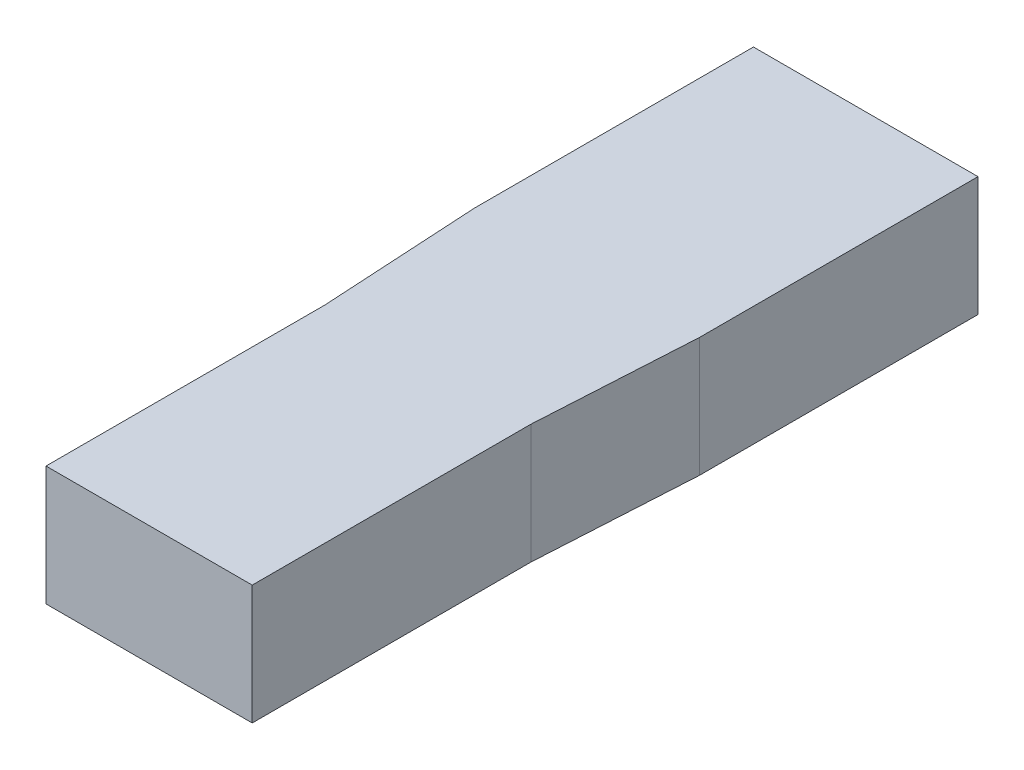
ISO-10303-21;
HEADER;
FILE_DESCRIPTION(('STEP AP214'),'2;1');
FILE_NAME('part.step','',(''),(''),'','','');
FILE_SCHEMA(('AUTOMOTIVE_DESIGN { 1 0 10303 214 1 1 1 1 }'));
ENDSEC;
DATA;
#1=APPLICATION_CONTEXT('core data for automotive mechanical design processes');
#2=APPLICATION_PROTOCOL_DEFINITION('international standard','automotive_design',2000,#1);
#3=PRODUCT_CONTEXT('',#1,'mechanical');
#4=PRODUCT('Part','Part','',(#3));
#5=PRODUCT_RELATED_PRODUCT_CATEGORY('part','',(#4));
#6=PRODUCT_DEFINITION_FORMATION('','',#4);
#7=PRODUCT_DEFINITION_CONTEXT('part definition',#1,'design');
#8=PRODUCT_DEFINITION('design','',#6,#7);
#9=PRODUCT_DEFINITION_SHAPE('','',#8);
#10=(LENGTH_UNIT() NAMED_UNIT(*) SI_UNIT(.MILLI.,.METRE.));
#11=(NAMED_UNIT(*) PLANE_ANGLE_UNIT() SI_UNIT($,.RADIAN.));
#12=(NAMED_UNIT(*) SI_UNIT($,.STERADIAN.) SOLID_ANGLE_UNIT());
#13=UNCERTAINTY_MEASURE_WITH_UNIT(LENGTH_MEASURE(1.E-05),#10,'distance_accuracy_value','');
#14=(GEOMETRIC_REPRESENTATION_CONTEXT(3) GLOBAL_UNCERTAINTY_ASSIGNED_CONTEXT((#13)) GLOBAL_UNIT_ASSIGNED_CONTEXT((#10,
#11,#12)) REPRESENTATION_CONTEXT('',''));
#15=CARTESIAN_POINT('',(0.,0.,0.));
#16=DIRECTION('',(0.,0.,1.));
#17=DIRECTION('',(1.,0.,0.));
#18=AXIS2_PLACEMENT_3D('',#15,#16,#17);
#19=CARTESIAN_POINT('',(2.82,3.,9.));
#20=DIRECTION('',(-1.,0.,0.));
#21=DIRECTION('',(0.,0.,1.));
#22=AXIS2_PLACEMENT_3D('',#19,#20,#21);
#23=PLANE('',#22);
#24=DIRECTION('',(0.,1.,0.));
#25=VECTOR('',#24,1.);
#26=CARTESIAN_POINT('',(2.82,0.,-2.));
#27=LINE('',#26,#25);
#28=CARTESIAN_POINT('',(2.82,0.,-2.));
#29=VERTEX_POINT('',#28);
#30=CARTESIAN_POINT('',(2.82,3.,-2.00000000000005));
#31=VERTEX_POINT('',#30);
#32=EDGE_CURVE('E66',#29,#31,#27,.T.);
#33=ORIENTED_EDGE('',*,*,#32,.F.);
#34=DIRECTION('',(0.,0.,-1.));
#35=VECTOR('',#34,1.);
#36=CARTESIAN_POINT('',(2.82,0.,9.));
#37=LINE('',#36,#35);
#38=CARTESIAN_POINT('',(2.82,0.,-9.));
#39=VERTEX_POINT('',#38);
#40=EDGE_CURVE('E105',#29,#39,#37,.T.);
#41=ORIENTED_EDGE('',*,*,#40,.T.);
#42=DIRECTION('',(0.,-1.,0.));
#43=VECTOR('',#42,1.);
#44=CARTESIAN_POINT('',(2.82,3.,-9.));
#45=LINE('',#44,#43);
#46=CARTESIAN_POINT('',(2.82,3.,-9.));
#47=VERTEX_POINT('',#46);
#48=EDGE_CURVE('E11',#47,#39,#45,.T.);
#49=ORIENTED_EDGE('',*,*,#48,.F.);
#50=DIRECTION('',(0.,0.,-1.));
#51=VECTOR('',#50,1.);
#52=CARTESIAN_POINT('',(2.82,3.,9.));
#53=LINE('',#52,#51);
#54=EDGE_CURVE('E82',#31,#47,#53,.T.);
#55=ORIENTED_EDGE('',*,*,#54,.F.);
#56=EDGE_LOOP('',(#33,#41,#49,#55));
#57=FACE_BOUND('',#56,.T.);
#58=ADVANCED_FACE('F33',(#57),#23,.F.);
#59=CARTESIAN_POINT('',(-2.82,3.,9.));
#60=DIRECTION('',(0.,0.,-1.));
#61=DIRECTION('',(-1.,0.,0.));
#62=AXIS2_PLACEMENT_3D('',#59,#60,#61);
#63=PLANE('',#62);
#64=DIRECTION('',(0.,1.,0.));
#65=VECTOR('',#64,1.);
#66=CARTESIAN_POINT('',(2.59,0.,9.));
#67=LINE('',#66,#65);
#68=CARTESIAN_POINT('',(2.59,0.,9.));
#69=VERTEX_POINT('',#68);
#70=CARTESIAN_POINT('',(2.59,3.,9.));
#71=VERTEX_POINT('',#70);
#72=EDGE_CURVE('E87',#69,#71,#67,.T.);
#73=ORIENTED_EDGE('',*,*,#72,.T.);
#74=DIRECTION('',(1.,0.,0.));
#75=VECTOR('',#74,1.);
#76=CARTESIAN_POINT('',(-2.82,3.,9.));
#77=LINE('',#76,#75);
#78=CARTESIAN_POINT('',(-2.59,3.,9.));
#79=VERTEX_POINT('',#78);
#80=EDGE_CURVE('E103',#79,#71,#77,.T.);
#81=ORIENTED_EDGE('',*,*,#80,.F.);
#82=DIRECTION('',(0.,1.,0.));
#83=VECTOR('',#82,1.);
#84=CARTESIAN_POINT('',(-2.59,0.,9.));
#85=LINE('',#84,#83);
#86=CARTESIAN_POINT('',(-2.59,0.,9.));
#87=VERTEX_POINT('',#86);
#88=EDGE_CURVE('E129',#87,#79,#85,.T.);
#89=ORIENTED_EDGE('',*,*,#88,.F.);
#90=DIRECTION('',(1.,0.,0.));
#91=VECTOR('',#90,1.);
#92=CARTESIAN_POINT('',(-2.82,0.,9.));
#93=LINE('',#92,#91);
#94=EDGE_CURVE('E90',#87,#69,#93,.T.);
#95=ORIENTED_EDGE('',*,*,#94,.T.);
#96=EDGE_LOOP('',(#73,#81,#89,#95));
#97=FACE_BOUND('',#96,.T.);
#98=ADVANCED_FACE('F186',(#97),#63,.F.);
#99=CARTESIAN_POINT('',(0.,3.,0.));
#100=DIRECTION('',(0.,-1.,0.));
#101=DIRECTION('',(0.,0.,-1.));
#102=AXIS2_PLACEMENT_3D('',#99,#100,#101);
#103=PLANE('',#102);
#104=DIRECTION('',(0.,0.,1.));
#105=VECTOR('',#104,1.);
#106=CARTESIAN_POINT('',(2.59,3.,0.));
#107=LINE('',#106,#105);
#108=CARTESIAN_POINT('',(2.59,3.,1.99999999999998));
#109=VERTEX_POINT('',#108);
#110=EDGE_CURVE('E86',#109,#71,#107,.T.);
#111=ORIENTED_EDGE('',*,*,#110,.F.);
#112=DIRECTION('',(-0.0574051803708747,0.,0.998350962971733));
#113=VECTOR('',#112,1.);
#114=CARTESIAN_POINT('',(2.82000000000001,3.,-2.0000000000001));
#115=LINE('',#114,#113);
#116=EDGE_CURVE('E36',#109,#31,#115,.F.);
#117=ORIENTED_EDGE('',*,*,#116,.T.);
#118=ORIENTED_EDGE('',*,*,#54,.T.);
#119=DIRECTION('',(-1.,0.,0.));
#120=VECTOR('',#119,1.);
#121=CARTESIAN_POINT('',(-2.82,3.,-9.));
#122=LINE('',#121,#120);
#123=CARTESIAN_POINT('',(-2.82,3.,-9.));
#124=VERTEX_POINT('',#123);
#125=EDGE_CURVE('E89',#47,#124,#122,.T.);
#126=ORIENTED_EDGE('',*,*,#125,.T.);
#127=DIRECTION('',(0.,0.,1.));
#128=VECTOR('',#127,1.);
#129=CARTESIAN_POINT('',(-2.82,3.,9.));
#130=LINE('',#129,#128);
#131=CARTESIAN_POINT('',(-2.82,3.,-2.00000000000003));
#132=VERTEX_POINT('',#131);
#133=EDGE_CURVE('E92',#124,#132,#130,.T.);
#134=ORIENTED_EDGE('',*,*,#133,.T.);
#135=DIRECTION('',(-0.0574051803708747,0.,-0.998350962971733));
#136=VECTOR('',#135,1.);
#137=CARTESIAN_POINT('',(-2.59,3.,2.));
#138=LINE('',#137,#136);
#139=CARTESIAN_POINT('',(-2.59,3.,1.99999999999996));
#140=VERTEX_POINT('',#139);
#141=EDGE_CURVE('E108',#140,#132,#138,.T.);
#142=ORIENTED_EDGE('',*,*,#141,.F.);
#143=DIRECTION('',(0.,0.,1.));
#144=VECTOR('',#143,1.);
#145=CARTESIAN_POINT('',(-2.59,3.,0.));
#146=LINE('',#145,#144);
#147=EDGE_CURVE('E98',#140,#79,#146,.T.);
#148=ORIENTED_EDGE('',*,*,#147,.T.);
#149=ORIENTED_EDGE('',*,*,#80,.T.);
#150=EDGE_LOOP('',(#111,#117,#118,#126,#134,#142,#148,#149));
#151=FACE_BOUND('',#150,.T.);
#152=ADVANCED_FACE('F79',(#151),#103,.F.);
#153=CARTESIAN_POINT('',(0.,0.,0.));
#154=DIRECTION('',(0.,-1.,0.));
#155=DIRECTION('',(0.,0.,-1.));
#156=AXIS2_PLACEMENT_3D('',#153,#154,#155);
#157=PLANE('',#156);
#158=DIRECTION('',(0.0574051803708747,0.,-0.998350962971733));
#159=VECTOR('',#158,1.);
#160=CARTESIAN_POINT('',(2.59,0.,2.));
#161=LINE('',#160,#159);
#162=CARTESIAN_POINT('',(2.59,0.,2.));
#163=VERTEX_POINT('',#162);
#164=EDGE_CURVE('E69',#163,#29,#161,.T.);
#165=ORIENTED_EDGE('',*,*,#164,.F.);
#166=DIRECTION('',(0.,0.,-1.));
#167=VECTOR('',#166,1.);
#168=CARTESIAN_POINT('',(2.59,0.,9.));
#169=LINE('',#168,#167);
#170=EDGE_CURVE('E74',#69,#163,#169,.T.);
#171=ORIENTED_EDGE('',*,*,#170,.F.);
#172=ORIENTED_EDGE('',*,*,#94,.F.);
#173=DIRECTION('',(0.,0.,-1.));
#174=VECTOR('',#173,1.);
#175=CARTESIAN_POINT('',(-2.59,0.,9.));
#176=LINE('',#175,#174);
#177=CARTESIAN_POINT('',(-2.59,0.,2.));
#178=VERTEX_POINT('',#177);
#179=EDGE_CURVE('E136',#87,#178,#176,.T.);
#180=ORIENTED_EDGE('',*,*,#179,.T.);
#181=DIRECTION('',(-0.0574051803708747,0.,-0.998350962971733));
#182=VECTOR('',#181,1.);
#183=CARTESIAN_POINT('',(-2.59,0.,2.));
#184=LINE('',#183,#182);
#185=CARTESIAN_POINT('',(-2.82,0.,-2.));
#186=VERTEX_POINT('',#185);
#187=EDGE_CURVE('E133',#178,#186,#184,.T.);
#188=ORIENTED_EDGE('',*,*,#187,.T.);
#189=DIRECTION('',(0.,0.,1.));
#190=VECTOR('',#189,1.);
#191=CARTESIAN_POINT('',(-2.82,0.,9.));
#192=LINE('',#191,#190);
#193=CARTESIAN_POINT('',(-2.82,0.,-9.));
#194=VERTEX_POINT('',#193);
#195=EDGE_CURVE('E95',#194,#186,#192,.T.);
#196=ORIENTED_EDGE('',*,*,#195,.F.);
#197=DIRECTION('',(-1.,0.,0.));
#198=VECTOR('',#197,1.);
#199=CARTESIAN_POINT('',(-2.82,0.,-9.));
#200=LINE('',#199,#198);
#201=EDGE_CURVE('E107',#39,#194,#200,.T.);
#202=ORIENTED_EDGE('',*,*,#201,.F.);
#203=ORIENTED_EDGE('',*,*,#40,.F.);
#204=EDGE_LOOP('',(#165,#171,#172,#180,#188,#196,#202,#203));
#205=FACE_BOUND('',#204,.T.);
#206=ADVANCED_FACE('F150',(#205),#157,.T.);
#207=CARTESIAN_POINT('',(-2.82,3.,-9.));
#208=DIRECTION('',(0.,0.,1.));
#209=DIRECTION('',(1.,0.,0.));
#210=AXIS2_PLACEMENT_3D('',#207,#208,#209);
#211=PLANE('',#210);
#212=ORIENTED_EDGE('',*,*,#201,.T.);
#213=DIRECTION('',(0.,-1.,0.));
#214=VECTOR('',#213,1.);
#215=CARTESIAN_POINT('',(-2.82,3.,-9.));
#216=LINE('',#215,#214);
#217=EDGE_CURVE('E42',#124,#194,#216,.T.);
#218=ORIENTED_EDGE('',*,*,#217,.F.);
#219=ORIENTED_EDGE('',*,*,#125,.F.);
#220=ORIENTED_EDGE('',*,*,#48,.T.);
#221=EDGE_LOOP('',(#212,#218,#219,#220));
#222=FACE_BOUND('',#221,.T.);
#223=ADVANCED_FACE('F173',(#222),#211,.F.);
#224=CARTESIAN_POINT('',(-2.82,3.,9.));
#225=DIRECTION('',(1.,0.,0.));
#226=DIRECTION('',(0.,0.,-1.));
#227=AXIS2_PLACEMENT_3D('',#224,#225,#226);
#228=PLANE('',#227);
#229=ORIENTED_EDGE('',*,*,#195,.T.);
#230=DIRECTION('',(0.,1.,0.));
#231=VECTOR('',#230,1.);
#232=CARTESIAN_POINT('',(-2.82,0.,-2.));
#233=LINE('',#232,#231);
#234=EDGE_CURVE('E121',#186,#132,#233,.T.);
#235=ORIENTED_EDGE('',*,*,#234,.T.);
#236=ORIENTED_EDGE('',*,*,#133,.F.);
#237=ORIENTED_EDGE('',*,*,#217,.T.);
#238=EDGE_LOOP('',(#229,#235,#236,#237));
#239=FACE_BOUND('',#238,.T.);
#240=ADVANCED_FACE('F174',(#239),#228,.F.);
#241=CARTESIAN_POINT('',(-2.59,0.,2.));
#242=DIRECTION('',(0.998350962971733,0.,-0.0574051803708747));
#243=DIRECTION('',(-0.0574051803708747,0.,-0.998350962971733));
#244=AXIS2_PLACEMENT_3D('',#241,#242,#243);
#245=PLANE('',#244);
#246=ORIENTED_EDGE('',*,*,#234,.F.);
#247=ORIENTED_EDGE('',*,*,#187,.F.);
#248=DIRECTION('',(0.,1.,0.));
#249=VECTOR('',#248,1.);
#250=CARTESIAN_POINT('',(-2.59,0.,2.));
#251=LINE('',#250,#249);
#252=EDGE_CURVE('E125',#178,#140,#251,.T.);
#253=ORIENTED_EDGE('',*,*,#252,.T.);
#254=ORIENTED_EDGE('',*,*,#141,.T.);
#255=EDGE_LOOP('',(#246,#247,#253,#254));
#256=FACE_BOUND('',#255,.T.);
#257=ADVANCED_FACE('F176',(#256),#245,.F.);
#258=CARTESIAN_POINT('',(-2.59,0.,9.));
#259=DIRECTION('',(1.,0.,0.));
#260=DIRECTION('',(0.,0.,-1.));
#261=AXIS2_PLACEMENT_3D('',#258,#259,#260);
#262=PLANE('',#261);
#263=ORIENTED_EDGE('',*,*,#252,.F.);
#264=ORIENTED_EDGE('',*,*,#179,.F.);
#265=ORIENTED_EDGE('',*,*,#88,.T.);
#266=ORIENTED_EDGE('',*,*,#147,.F.);
#267=EDGE_LOOP('',(#263,#264,#265,#266));
#268=FACE_BOUND('',#267,.T.);
#269=ADVANCED_FACE('F182',(#268),#262,.F.);
#270=CARTESIAN_POINT('',(2.59,0.,9.));
#271=DIRECTION('',(1.,0.,0.));
#272=DIRECTION('',(0.,0.,-1.));
#273=AXIS2_PLACEMENT_3D('',#270,#271,#272);
#274=PLANE('',#273);
#275=ORIENTED_EDGE('',*,*,#110,.T.);
#276=ORIENTED_EDGE('',*,*,#72,.F.);
#277=ORIENTED_EDGE('',*,*,#170,.T.);
#278=DIRECTION('',(0.,1.,0.));
#279=VECTOR('',#278,1.);
#280=CARTESIAN_POINT('',(2.59,0.,2.));
#281=LINE('',#280,#279);
#282=EDGE_CURVE('E51',#163,#109,#281,.T.);
#283=ORIENTED_EDGE('',*,*,#282,.T.);
#284=EDGE_LOOP('',(#275,#276,#277,#283));
#285=FACE_BOUND('',#284,.T.);
#286=ADVANCED_FACE('F147',(#285),#274,.T.);
#287=CARTESIAN_POINT('',(2.59,0.,2.));
#288=DIRECTION('',(0.998350962971733,0.,0.0574051803708747));
#289=DIRECTION('',(0.0574051803708747,0.,-0.998350962971733));
#290=AXIS2_PLACEMENT_3D('',#287,#288,#289);
#291=PLANE('',#290);
#292=ORIENTED_EDGE('',*,*,#116,.F.);
#293=ORIENTED_EDGE('',*,*,#282,.F.);
#294=ORIENTED_EDGE('',*,*,#164,.T.);
#295=ORIENTED_EDGE('',*,*,#32,.T.);
#296=EDGE_LOOP('',(#292,#293,#294,#295));
#297=FACE_BOUND('',#296,.T.);
#298=ADVANCED_FACE('F67',(#297),#291,.T.);
#299=CLOSED_SHELL('',(#58,#98,#152,#206,#223,#240,#257,#269,#286,#298));
#300=MANIFOLD_SOLID_BREP('B2',#299);
#301=ADVANCED_BREP_SHAPE_REPRESENTATION('',(#18,#300),#14);
#302=SHAPE_DEFINITION_REPRESENTATION(#9,#301);
ENDSEC;
END-ISO-10303-21;
